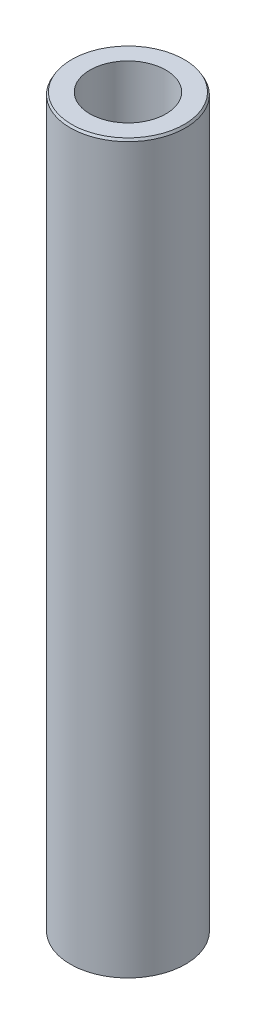
ISO-10303-21;
HEADER;
FILE_DESCRIPTION(('STEP AP214'),'2;1');
FILE_NAME('part.step','',(''),(''),'','','');
FILE_SCHEMA(('AUTOMOTIVE_DESIGN { 1 0 10303 214 1 1 1 1 }'));
ENDSEC;
DATA;
#1=APPLICATION_CONTEXT('core data for automotive mechanical design processes');
#2=APPLICATION_PROTOCOL_DEFINITION('international standard','automotive_design',2000,#1);
#3=PRODUCT_CONTEXT('',#1,'mechanical');
#4=PRODUCT('Part','Part','',(#3));
#5=PRODUCT_RELATED_PRODUCT_CATEGORY('part','',(#4));
#6=PRODUCT_DEFINITION_FORMATION('','',#4);
#7=PRODUCT_DEFINITION_CONTEXT('part definition',#1,'design');
#8=PRODUCT_DEFINITION('design','',#6,#7);
#9=PRODUCT_DEFINITION_SHAPE('','',#8);
#10=(LENGTH_UNIT() NAMED_UNIT(*) SI_UNIT(.MILLI.,.METRE.));
#11=(NAMED_UNIT(*) PLANE_ANGLE_UNIT() SI_UNIT($,.RADIAN.));
#12=(NAMED_UNIT(*) SI_UNIT($,.STERADIAN.) SOLID_ANGLE_UNIT());
#13=UNCERTAINTY_MEASURE_WITH_UNIT(LENGTH_MEASURE(1.E-05),#10,'distance_accuracy_value','');
#14=(GEOMETRIC_REPRESENTATION_CONTEXT(3) GLOBAL_UNCERTAINTY_ASSIGNED_CONTEXT((#13)) GLOBAL_UNIT_ASSIGNED_CONTEXT((#10,
#11,#12)) REPRESENTATION_CONTEXT('',''));
#15=CARTESIAN_POINT('',(0.,0.,0.));
#16=DIRECTION('',(0.,0.,1.));
#17=DIRECTION('',(1.,0.,0.));
#18=AXIS2_PLACEMENT_3D('',#15,#16,#17);
#19=CARTESIAN_POINT('',(0.,600.,0.));
#20=DIRECTION('',(0.,-1.,0.));
#21=DIRECTION('',(0.,0.,-1.));
#22=AXIS2_PLACEMENT_3D('',#19,#20,#21);
#23=CYLINDRICAL_SURFACE('',#22,47.5);
#24=CARTESIAN_POINT('',(0.,598.068839627731,0.));
#25=DIRECTION('',(0.,1.,0.));
#26=DIRECTION('',(0.,0.,1.));
#27=AXIS2_PLACEMENT_3D('',#24,#25,#26);
#28=CIRCLE('',#27,47.5);
#29=CARTESIAN_POINT('',(0.,598.068839627731,47.5));
#30=VERTEX_POINT('',#29);
#31=EDGE_CURVE('E50',#30,#30,#28,.F.);
#32=ORIENTED_EDGE('',*,*,#31,.T.);
#33=EDGE_LOOP('',(#32));
#34=FACE_BOUND('',#33,.T.);
#35=CARTESIAN_POINT('',(0.,1.11495596077793,0.));
#36=DIRECTION('',(0.,1.,0.));
#37=DIRECTION('',(0.,0.,1.));
#38=AXIS2_PLACEMENT_3D('',#35,#36,#37);
#39=CIRCLE('',#38,47.5);
#40=CARTESIAN_POINT('',(0.,1.11495596077793,47.5));
#41=VERTEX_POINT('',#40);
#42=EDGE_CURVE('E51',#41,#41,#39,.T.);
#43=ORIENTED_EDGE('',*,*,#42,.T.);
#44=EDGE_LOOP('',(#43));
#45=FACE_BOUND('',#44,.T.);
#46=ADVANCED_FACE('F39',(#34,#45),#23,.T.);
#47=CARTESIAN_POINT('',(0.,600.,0.));
#48=DIRECTION('',(0.,1.,0.));
#49=DIRECTION('',(0.,0.,1.));
#50=AXIS2_PLACEMENT_3D('',#47,#48,#49);
#51=PLANE('',#50);
#52=CARTESIAN_POINT('',(0.,600.,0.));
#53=DIRECTION('',(0.,1.,0.));
#54=DIRECTION('',(0.,0.,1.));
#55=AXIS2_PLACEMENT_3D('',#52,#53,#54);
#56=CIRCLE('',#55,46.3850440392221);
#57=CARTESIAN_POINT('',(0.,600.,46.3850440392221));
#58=VERTEX_POINT('',#57);
#59=EDGE_CURVE('E54',#58,#58,#56,.T.);
#60=ORIENTED_EDGE('',*,*,#59,.T.);
#61=EDGE_LOOP('',(#60));
#62=FACE_BOUND('',#61,.T.);
#63=CARTESIAN_POINT('',(0.,600.,0.));
#64=DIRECTION('',(0.,1.,0.));
#65=DIRECTION('',(0.,0.,1.));
#66=AXIS2_PLACEMENT_3D('',#63,#64,#65);
#67=CIRCLE('',#66,31.3224398777633);
#68=CARTESIAN_POINT('',(0.,600.,31.3224398777633));
#69=VERTEX_POINT('',#68);
#70=EDGE_CURVE('E58',#69,#69,#67,.T.);
#71=ORIENTED_EDGE('',*,*,#70,.F.);
#72=EDGE_LOOP('',(#71));
#73=FACE_BOUND('',#72,.T.);
#74=ADVANCED_FACE('F69',(#62,#73),#51,.T.);
#75=CARTESIAN_POINT('',(0.,0.,0.));
#76=DIRECTION('',(0.,1.,0.));
#77=DIRECTION('',(0.,0.,1.));
#78=AXIS2_PLACEMENT_3D('',#75,#76,#77);
#79=PLANE('',#78);
#80=CARTESIAN_POINT('',(0.,0.,0.));
#81=DIRECTION('',(0.,1.,0.));
#82=DIRECTION('',(0.,0.,1.));
#83=AXIS2_PLACEMENT_3D('',#80,#81,#82);
#84=CIRCLE('',#83,45.5688396277308);
#85=CARTESIAN_POINT('',(0.,0.,45.5688396277308));
#86=VERTEX_POINT('',#85);
#87=EDGE_CURVE('E10',#86,#86,#84,.F.);
#88=ORIENTED_EDGE('',*,*,#87,.T.);
#89=EDGE_LOOP('',(#88));
#90=FACE_BOUND('',#89,.T.);
#91=CARTESIAN_POINT('',(0.,0.,0.));
#92=DIRECTION('',(0.,1.,0.));
#93=DIRECTION('',(0.,0.,1.));
#94=AXIS2_PLACEMENT_3D('',#91,#92,#93);
#95=CIRCLE('',#94,31.3224398777633);
#96=CARTESIAN_POINT('',(0.,0.,31.3224398777633));
#97=VERTEX_POINT('',#96);
#98=EDGE_CURVE('E63',#97,#97,#95,.T.);
#99=ORIENTED_EDGE('',*,*,#98,.T.);
#100=EDGE_LOOP('',(#99));
#101=FACE_BOUND('',#100,.T.);
#102=ADVANCED_FACE('F75',(#90,#101),#79,.F.);
#103=CARTESIAN_POINT('',(0.,600.,0.));
#104=DIRECTION('',(0.,-1.,0.));
#105=DIRECTION('',(0.,0.,-1.));
#106=AXIS2_PLACEMENT_3D('',#103,#104,#105);
#107=CYLINDRICAL_SURFACE('',#106,31.3224398777633);
#108=ORIENTED_EDGE('',*,*,#70,.T.);
#109=EDGE_LOOP('',(#108));
#110=FACE_BOUND('',#109,.T.);
#111=ORIENTED_EDGE('',*,*,#98,.F.);
#112=EDGE_LOOP('',(#111));
#113=FACE_BOUND('',#112,.T.);
#114=ADVANCED_FACE('F70',(#110,#113),#107,.F.);
#115=CARTESIAN_POINT('',(0.,600.,0.));
#116=DIRECTION('',(0.,-1.,0.));
#117=DIRECTION('',(0.,0.,-1.));
#118=AXIS2_PLACEMENT_3D('',#115,#116,#117);
#119=CONICAL_SURFACE('',#118,46.3850440392221,0.523598775598282);
#120=ORIENTED_EDGE('',*,*,#31,.F.);
#121=EDGE_LOOP('',(#120));
#122=FACE_BOUND('',#121,.T.);
#123=ORIENTED_EDGE('',*,*,#59,.F.);
#124=EDGE_LOOP('',(#123));
#125=FACE_BOUND('',#124,.T.);
#126=ADVANCED_FACE('F81',(#122,#125),#119,.T.);
#127=CARTESIAN_POINT('',(0.,1.11495596077793,0.));
#128=DIRECTION('',(0.,1.,0.));
#129=DIRECTION('',(0.,0.,1.));
#130=AXIS2_PLACEMENT_3D('',#127,#128,#129);
#131=CONICAL_SURFACE('',#130,47.5,1.0471975511966);
#132=ORIENTED_EDGE('',*,*,#87,.F.);
#133=EDGE_LOOP('',(#132));
#134=FACE_BOUND('',#133,.T.);
#135=ORIENTED_EDGE('',*,*,#42,.F.);
#136=EDGE_LOOP('',(#135));
#137=FACE_BOUND('',#136,.T.);
#138=ADVANCED_FACE('F45',(#134,#137),#131,.T.);
#139=CLOSED_SHELL('',(#46,#74,#102,#114,#126,#138));
#140=MANIFOLD_SOLID_BREP('B2',#139);
#141=ADVANCED_BREP_SHAPE_REPRESENTATION('',(#18,#140),#14);
#142=SHAPE_DEFINITION_REPRESENTATION(#9,#141);
ENDSEC;
END-ISO-10303-21;
